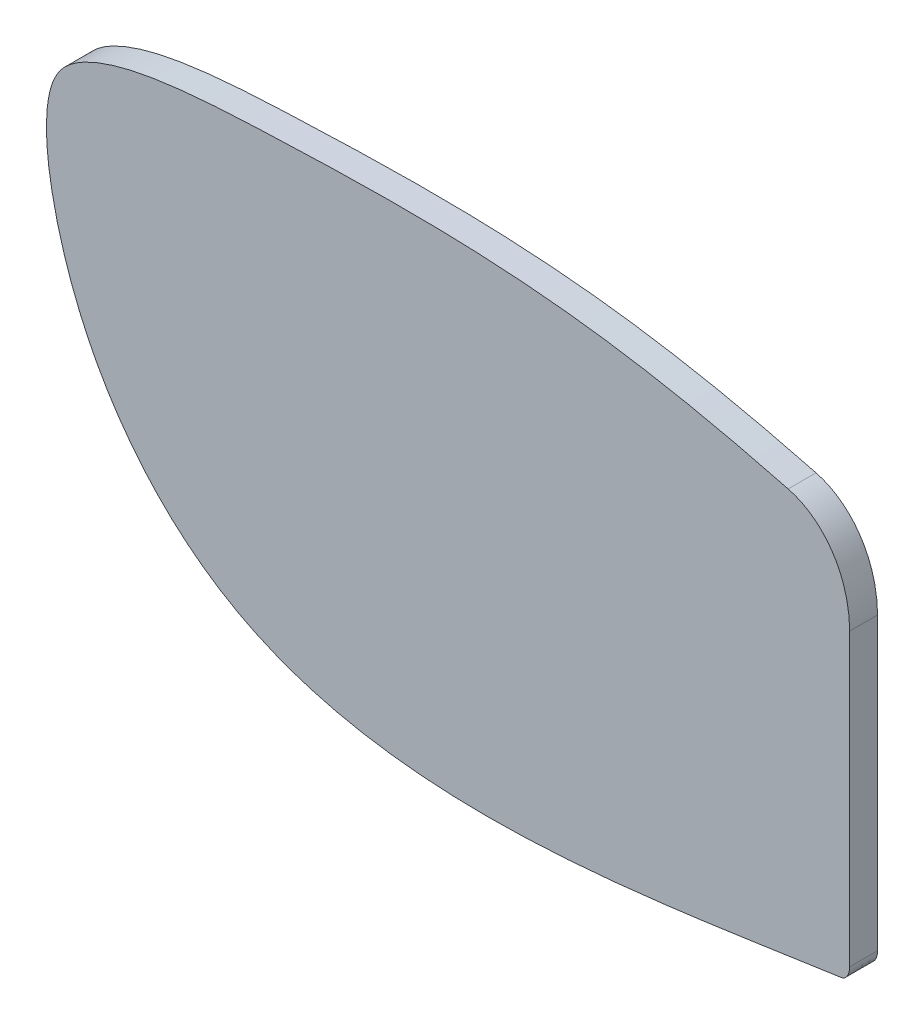
ISO-10303-21;
HEADER;
FILE_DESCRIPTION(('STEP AP214'),'2;1');
FILE_NAME('part.step','',(''),(''),'','','');
FILE_SCHEMA(('AUTOMOTIVE_DESIGN { 1 0 10303 214 1 1 1 1 }'));
ENDSEC;
DATA;
#1=APPLICATION_CONTEXT('core data for automotive mechanical design processes');
#2=APPLICATION_PROTOCOL_DEFINITION('international standard','automotive_design',2000,#1);
#3=PRODUCT_CONTEXT('',#1,'mechanical');
#4=PRODUCT('Part','Part','',(#3));
#5=PRODUCT_RELATED_PRODUCT_CATEGORY('part','',(#4));
#6=PRODUCT_DEFINITION_FORMATION('','',#4);
#7=PRODUCT_DEFINITION_CONTEXT('part definition',#1,'design');
#8=PRODUCT_DEFINITION('design','',#6,#7);
#9=PRODUCT_DEFINITION_SHAPE('','',#8);
#10=(LENGTH_UNIT() NAMED_UNIT(*) SI_UNIT(.MILLI.,.METRE.));
#11=(NAMED_UNIT(*) PLANE_ANGLE_UNIT() SI_UNIT($,.RADIAN.));
#12=(NAMED_UNIT(*) SI_UNIT($,.STERADIAN.) SOLID_ANGLE_UNIT());
#13=UNCERTAINTY_MEASURE_WITH_UNIT(LENGTH_MEASURE(1.E-05),#10,'distance_accuracy_value','');
#14=(GEOMETRIC_REPRESENTATION_CONTEXT(3) GLOBAL_UNCERTAINTY_ASSIGNED_CONTEXT((#13)) GLOBAL_UNIT_ASSIGNED_CONTEXT((#10,
#11,#12)) REPRESENTATION_CONTEXT('',''));
#15=CARTESIAN_POINT('',(0.,0.,0.));
#16=DIRECTION('',(0.,0.,1.));
#17=DIRECTION('',(1.,0.,0.));
#18=AXIS2_PLACEMENT_3D('',#15,#16,#17);
#19=CARTESIAN_POINT('',(-34.6405085543592,11.5409215445079,1.));
#20=CARTESIAN_POINT('',(-34.609785166655,11.5452969130987,1.));
#21=CARTESIAN_POINT('',(-34.5560924016401,11.5635022560741,1.));
#22=CARTESIAN_POINT('',(-34.4568877985769,11.6456922101736,1.));
#23=CARTESIAN_POINT('',(-34.3693953225844,11.8010416182449,1.));
#24=CARTESIAN_POINT('',(-34.3449047087784,11.9508699657467,1.));
#25=CARTESIAN_POINT('',(-34.3449047087783,12.0212940122954,1.));
#26=B_SPLINE_CURVE_WITH_KNOTS('',3,(#19,#20,#21,#22,#23,#24,#25),.UNSPECIFIED.,.F.,.F.,(4,1,1,1,
4),(0.,0.25,0.5,0.75,1.),.UNSPECIFIED.);
#27=DIRECTION('',(0.,0.,-1.));
#28=VECTOR('',#27,1.);
#29=SURFACE_OF_LINEAR_EXTRUSION('',#26,#28);
#30=CARTESIAN_POINT('',(-34.6405085543592,11.5409215445079,0.));
#31=CARTESIAN_POINT('',(-34.609785166655,11.5452969130987,0.));
#32=CARTESIAN_POINT('',(-34.5560924016401,11.5635022560741,0.));
#33=CARTESIAN_POINT('',(-34.4568877985769,11.6456922101736,0.));
#34=CARTESIAN_POINT('',(-34.3693953225844,11.8010416182449,0.));
#35=CARTESIAN_POINT('',(-34.3449047087784,11.9508699657467,0.));
#36=CARTESIAN_POINT('',(-34.3449047087783,12.0212940122954,0.));
#37=B_SPLINE_CURVE_WITH_KNOTS('',3,(#30,#31,#32,#33,#34,#35,#36),.UNSPECIFIED.,.F.,.F.,(4,1,1,1,
4),(0.,0.25,0.5,0.75,1.),.UNSPECIFIED.);
#38=CARTESIAN_POINT('',(-34.6405085543592,11.5409215445079,0.));
#39=VERTEX_POINT('',#38);
#40=CARTESIAN_POINT('',(-34.3449047087783,12.0212940122954,0.));
#41=VERTEX_POINT('',#40);
#42=EDGE_CURVE('E138',#39,#41,#37,.T.);
#43=ORIENTED_EDGE('',*,*,#42,.T.);
#44=DIRECTION('',(0.,0.,-1.));
#45=VECTOR('',#44,1.);
#46=CARTESIAN_POINT('',(-34.3449047087783,12.0212940122954,1.));
#47=LINE('',#46,#45);
#48=CARTESIAN_POINT('',(-34.3449047087783,12.0212940122954,1.));
#49=VERTEX_POINT('',#48);
#50=EDGE_CURVE('E11',#49,#41,#47,.T.);
#51=ORIENTED_EDGE('',*,*,#50,.F.);
#52=CARTESIAN_POINT('',(-34.6405085543592,11.5409215445079,1.));
#53=VERTEX_POINT('',#52);
#54=EDGE_CURVE('E100',#53,#49,#26,.T.);
#55=ORIENTED_EDGE('',*,*,#54,.F.);
#56=DIRECTION('',(0.,0.,-1.));
#57=VECTOR('',#56,1.);
#58=CARTESIAN_POINT('',(-34.6405085543592,11.5409215445079,1.));
#59=LINE('',#58,#57);
#60=EDGE_CURVE('E112',#53,#39,#59,.T.);
#61=ORIENTED_EDGE('',*,*,#60,.T.);
#62=EDGE_LOOP('',(#43,#51,#55,#61));
#63=FACE_BOUND('',#62,.T.);
#64=ADVANCED_FACE('F47',(#63),#29,.F.);
#65=CARTESIAN_POINT('',(-34.3449047087783,22.4530207053056,1.));
#66=DIRECTION('',(-1.,0.,0.));
#67=DIRECTION('',(0.,-1.,0.));
#68=AXIS2_PLACEMENT_3D('',#65,#66,#67);
#69=PLANE('',#68);
#70=DIRECTION('',(0.,1.,0.));
#71=VECTOR('',#70,1.);
#72=CARTESIAN_POINT('',(-34.3449047087783,22.4530207053056,0.));
#73=LINE('',#72,#71);
#74=CARTESIAN_POINT('',(-34.3449047087783,22.4530207053056,0.));
#75=VERTEX_POINT('',#74);
#76=EDGE_CURVE('E105',#41,#75,#73,.T.);
#77=ORIENTED_EDGE('',*,*,#76,.T.);
#78=DIRECTION('',(0.,0.,-1.));
#79=VECTOR('',#78,1.);
#80=CARTESIAN_POINT('',(-34.3449047087783,22.4530207053056,1.));
#81=LINE('',#80,#79);
#82=CARTESIAN_POINT('',(-34.3449047087783,22.4530207053056,1.));
#83=VERTEX_POINT('',#82);
#84=EDGE_CURVE('E57',#83,#75,#81,.T.);
#85=ORIENTED_EDGE('',*,*,#84,.F.);
#86=DIRECTION('',(0.,1.,0.));
#87=VECTOR('',#86,1.);
#88=CARTESIAN_POINT('',(-34.3449047087783,22.4530207053056,1.));
#89=LINE('',#88,#87);
#90=EDGE_CURVE('E95',#49,#83,#89,.T.);
#91=ORIENTED_EDGE('',*,*,#90,.F.);
#92=ORIENTED_EDGE('',*,*,#50,.T.);
#93=EDGE_LOOP('',(#77,#85,#91,#92));
#94=FACE_BOUND('',#93,.T.);
#95=ADVANCED_FACE('F104',(#94),#69,.F.);
#96=CARTESIAN_POINT('',(-34.3449047087783,22.4530207053056,1.));
#97=CARTESIAN_POINT('',(-34.3449047087783,22.8542803944533,1.));
#98=CARTESIAN_POINT('',(-34.4651842585097,23.6831192713599,1.));
#99=CARTESIAN_POINT('',(-34.9576598106449,24.6941021146581,1.));
#100=CARTESIAN_POINT('',(-35.6681562285622,25.4156174289946,1.));
#101=CARTESIAN_POINT('',(-36.2469370607251,25.6862618779979,1.));
#102=CARTESIAN_POINT('',(-36.552758896595,25.7662231965494,1.));
#103=B_SPLINE_CURVE_WITH_KNOTS('',3,(#96,#97,#98,#99,#100,#101,#102),.UNSPECIFIED.,.F.,.F.,(4,1,
1,1,4),(0.,0.25,0.5,0.75,1.),.UNSPECIFIED.);
#104=DIRECTION('',(0.,0.,-1.));
#105=VECTOR('',#104,1.);
#106=SURFACE_OF_LINEAR_EXTRUSION('',#103,#105);
#107=CARTESIAN_POINT('',(-34.3449047087783,22.4530207053056,0.));
#108=CARTESIAN_POINT('',(-34.3449047087783,22.8542803944533,0.));
#109=CARTESIAN_POINT('',(-34.4651842585097,23.6831192713599,0.));
#110=CARTESIAN_POINT('',(-34.9576598106449,24.6941021146581,0.));
#111=CARTESIAN_POINT('',(-35.6681562285622,25.4156174289946,0.));
#112=CARTESIAN_POINT('',(-36.2469370607251,25.6862618779979,0.));
#113=CARTESIAN_POINT('',(-36.552758896595,25.7662231965494,0.));
#114=B_SPLINE_CURVE_WITH_KNOTS('',3,(#107,#108,#109,#110,#111,#112,#113),.UNSPECIFIED.,.F.,.F.,
(4,1,1,1,4),(0.,0.25,0.5,0.75,1.),.UNSPECIFIED.);
#115=CARTESIAN_POINT('',(-36.552758896595,25.7662231965494,0.));
#116=VERTEX_POINT('',#115);
#117=EDGE_CURVE('E82',#75,#116,#114,.T.);
#118=ORIENTED_EDGE('',*,*,#117,.T.);
#119=DIRECTION('',(0.,0.,-1.));
#120=VECTOR('',#119,1.);
#121=CARTESIAN_POINT('',(-36.552758896595,25.7662231965494,1.));
#122=LINE('',#121,#120);
#123=CARTESIAN_POINT('',(-36.552758896595,25.7662231965494,1.));
#124=VERTEX_POINT('',#123);
#125=EDGE_CURVE('E107',#124,#116,#122,.T.);
#126=ORIENTED_EDGE('',*,*,#125,.F.);
#127=EDGE_CURVE('E98',#83,#124,#103,.T.);
#128=ORIENTED_EDGE('',*,*,#127,.F.);
#129=ORIENTED_EDGE('',*,*,#84,.T.);
#130=EDGE_LOOP('',(#118,#126,#128,#129));
#131=FACE_BOUND('',#130,.T.);
#132=ADVANCED_FACE('F108',(#131),#106,.F.);
#133=CARTESIAN_POINT('',(-36.552758896595,25.7662231965494,1.));
#134=CARTESIAN_POINT('',(-37.1719926546955,25.9281303659589,1.));
#135=CARTESIAN_POINT('',(-38.3947083096392,26.2327104848263,1.));
#136=CARTESIAN_POINT('',(-41.0152073496267,26.8030483688778,1.));
#137=CARTESIAN_POINT('',(-44.380700371636,27.3366338743357,1.));
#138=CARTESIAN_POINT('',(-48.4913493274221,27.6041483569067,1.));
#139=CARTESIAN_POINT('',(-51.9382000873666,27.5843153059658,1.));
#140=CARTESIAN_POINT('',(-54.7215182293094,27.4903619956559,1.));
#141=CARTESIAN_POINT('',(-56.8201697317824,27.4043655518796,1.));
#142=CARTESIAN_POINT('',(-58.8860592893083,27.234833276128,1.));
#143=CARTESIAN_POINT('',(-60.5910983004473,26.9172004731643,1.));
#144=CARTESIAN_POINT('',(-61.8401287523169,26.4238062207455,1.));
#145=CARTESIAN_POINT('',(-62.6222466462086,25.8766532306266,1.));
#146=CARTESIAN_POINT('',(-63.0306995067451,25.0970138827761,1.));
#147=CARTESIAN_POINT('',(-63.2251440884005,23.7437714353599,1.));
#148=CARTESIAN_POINT('',(-63.0433008920956,21.9763349922321,1.));
#149=CARTESIAN_POINT('',(-62.5162198140846,19.8974302352628,1.));
#150=CARTESIAN_POINT('',(-61.7229249635995,17.8966906473781,1.));
#151=CARTESIAN_POINT('',(-60.6710818611623,16.0538751967377,1.));
#152=CARTESIAN_POINT('',(-59.3570529021899,14.3914616534518,1.));
#153=CARTESIAN_POINT('',(-57.8333160725114,12.9983525759514,1.));
#154=CARTESIAN_POINT('',(-56.1228470134817,11.9049317768598,1.));
#155=CARTESIAN_POINT('',(-53.6081339733073,10.854099917284,1.));
#156=CARTESIAN_POINT('',(-50.2721373222712,10.22319099998,1.));
#157=CARTESIAN_POINT('',(-46.2296802716102,10.1428007075067,1.));
#158=CARTESIAN_POINT('',(-42.8457892586499,10.4135310209445,1.));
#159=CARTESIAN_POINT('',(-40.1635034452211,10.7408692476834,1.));
#160=CARTESIAN_POINT('',(-38.2068634460735,11.0154346547878,1.));
#161=CARTESIAN_POINT('',(-36.3388966063648,11.293164198505,1.));
#162=CARTESIAN_POINT('',(-35.2172426601858,11.4587878841126,1.));
#163=CARTESIAN_POINT('',(-34.6405085543592,11.5409215445079,1.));
#164=B_SPLINE_CURVE_WITH_KNOTS('',3,(#133,#134,#135,#136,#137,#138,#139,#140,#141,#142,#143,
#144,#145,#146,#147,#148,#149,#150,#151,#152,#153,#154,#155,#156,#157,#158,#159,#160,#161,#162,
#163),.UNSPECIFIED.,.F.,.F.,(4,1,1,1,1,1,1,1,1,1,1,1,1,1,1,1,1,1,1,1,1,1,1,1,1,1,1,1,4),(0.,
0.03125,0.0625,0.125,0.1875,0.25,0.28125,0.3125,0.34375,0.375,0.390625,0.40625,0.421875,0.4375,
0.46875,0.5,0.53125,0.5625,0.59375,0.625,0.65625,0.6875,0.75,0.8125,0.875,0.90625,0.9375,
0.96875,1.),.UNSPECIFIED.);
#165=DIRECTION('',(0.,0.,-1.));
#166=VECTOR('',#165,1.);
#167=SURFACE_OF_LINEAR_EXTRUSION('',#164,#166);
#168=CARTESIAN_POINT('',(-36.552758896595,25.7662231965494,0.));
#169=CARTESIAN_POINT('',(-37.1719926546955,25.9281303659589,0.));
#170=CARTESIAN_POINT('',(-38.3947083096392,26.2327104848263,0.));
#171=CARTESIAN_POINT('',(-41.0152073496267,26.8030483688778,0.));
#172=CARTESIAN_POINT('',(-44.380700371636,27.3366338743357,0.));
#173=CARTESIAN_POINT('',(-48.4913493274221,27.6041483569067,0.));
#174=CARTESIAN_POINT('',(-51.9382000873666,27.5843153059658,0.));
#175=CARTESIAN_POINT('',(-54.7215182293094,27.4903619956559,0.));
#176=CARTESIAN_POINT('',(-56.8201697317824,27.4043655518796,0.));
#177=CARTESIAN_POINT('',(-58.8860592893083,27.234833276128,0.));
#178=CARTESIAN_POINT('',(-60.5910983004473,26.9172004731643,0.));
#179=CARTESIAN_POINT('',(-61.8401287523169,26.4238062207455,0.));
#180=CARTESIAN_POINT('',(-62.6222466462086,25.8766532306266,0.));
#181=CARTESIAN_POINT('',(-63.0306995067451,25.0970138827761,0.));
#182=CARTESIAN_POINT('',(-63.2251440884005,23.7437714353599,0.));
#183=CARTESIAN_POINT('',(-63.0433008920956,21.9763349922321,0.));
#184=CARTESIAN_POINT('',(-62.5162198140846,19.8974302352628,0.));
#185=CARTESIAN_POINT('',(-61.7229249635995,17.8966906473781,0.));
#186=CARTESIAN_POINT('',(-60.6710818611623,16.0538751967377,0.));
#187=CARTESIAN_POINT('',(-59.3570529021899,14.3914616534518,0.));
#188=CARTESIAN_POINT('',(-57.8333160725114,12.9983525759514,0.));
#189=CARTESIAN_POINT('',(-56.1228470134817,11.9049317768598,0.));
#190=CARTESIAN_POINT('',(-53.6081339733073,10.854099917284,0.));
#191=CARTESIAN_POINT('',(-50.2721373222712,10.22319099998,0.));
#192=CARTESIAN_POINT('',(-46.2296802716102,10.1428007075067,0.));
#193=CARTESIAN_POINT('',(-42.8457892586499,10.4135310209445,0.));
#194=CARTESIAN_POINT('',(-40.1635034452211,10.7408692476834,0.));
#195=CARTESIAN_POINT('',(-38.2068634460735,11.0154346547878,0.));
#196=CARTESIAN_POINT('',(-36.3388966063648,11.293164198505,0.));
#197=CARTESIAN_POINT('',(-35.2172426601858,11.4587878841126,0.));
#198=CARTESIAN_POINT('',(-34.6405085543592,11.5409215445079,0.));
#199=B_SPLINE_CURVE_WITH_KNOTS('',3,(#168,#169,#170,#171,#172,#173,#174,#175,#176,#177,#178,
#179,#180,#181,#182,#183,#184,#185,#186,#187,#188,#189,#190,#191,#192,#193,#194,#195,#196,#197,
#198),.UNSPECIFIED.,.F.,.F.,(4,1,1,1,1,1,1,1,1,1,1,1,1,1,1,1,1,1,1,1,1,1,1,1,1,1,1,1,4),(0.,
0.03125,0.0625,0.125,0.1875,0.25,0.28125,0.3125,0.34375,0.375,0.390625,0.40625,0.421875,0.4375,
0.46875,0.5,0.53125,0.5625,0.59375,0.625,0.65625,0.6875,0.75,0.8125,0.875,0.90625,0.9375,
0.96875,1.),.UNSPECIFIED.);
#200=EDGE_CURVE('E88',#116,#39,#199,.T.);
#201=ORIENTED_EDGE('',*,*,#200,.T.);
#202=ORIENTED_EDGE('',*,*,#60,.F.);
#203=EDGE_CURVE('E65',#124,#53,#164,.T.);
#204=ORIENTED_EDGE('',*,*,#203,.F.);
#205=ORIENTED_EDGE('',*,*,#125,.T.);
#206=EDGE_LOOP('',(#201,#202,#204,#205));
#207=FACE_BOUND('',#206,.T.);
#208=ADVANCED_FACE('F127',(#207),#167,.F.);
#209=CARTESIAN_POINT('',(-34.4588398197554,11.6578854525022,1.));
#210=DIRECTION('',(0.,0.,1.));
#211=DIRECTION('',(1.,0.,0.));
#212=AXIS2_PLACEMENT_3D('',#209,#210,#211);
#213=PLANE('',#212);
#214=ORIENTED_EDGE('',*,*,#54,.T.);
#215=ORIENTED_EDGE('',*,*,#90,.T.);
#216=ORIENTED_EDGE('',*,*,#127,.T.);
#217=ORIENTED_EDGE('',*,*,#203,.T.);
#218=EDGE_LOOP('',(#214,#215,#216,#217));
#219=FACE_BOUND('',#218,.T.);
#220=ADVANCED_FACE('F96',(#219),#213,.T.);
#221=CARTESIAN_POINT('',(-34.4588398197554,11.6578854525022,0.));
#222=DIRECTION('',(0.,0.,1.));
#223=DIRECTION('',(1.,0.,0.));
#224=AXIS2_PLACEMENT_3D('',#221,#222,#223);
#225=PLANE('',#224);
#226=ORIENTED_EDGE('',*,*,#42,.F.);
#227=ORIENTED_EDGE('',*,*,#200,.F.);
#228=ORIENTED_EDGE('',*,*,#117,.F.);
#229=ORIENTED_EDGE('',*,*,#76,.F.);
#230=EDGE_LOOP('',(#226,#227,#228,#229));
#231=FACE_BOUND('',#230,.T.);
#232=ADVANCED_FACE('F166',(#231),#225,.F.);
#233=CLOSED_SHELL('',(#64,#95,#132,#208,#220,#232));
#234=MANIFOLD_SOLID_BREP('B2',#233);
#235=ADVANCED_BREP_SHAPE_REPRESENTATION('',(#18,#234),#14);
#236=SHAPE_DEFINITION_REPRESENTATION(#9,#235);
ENDSEC;
END-ISO-10303-21;
